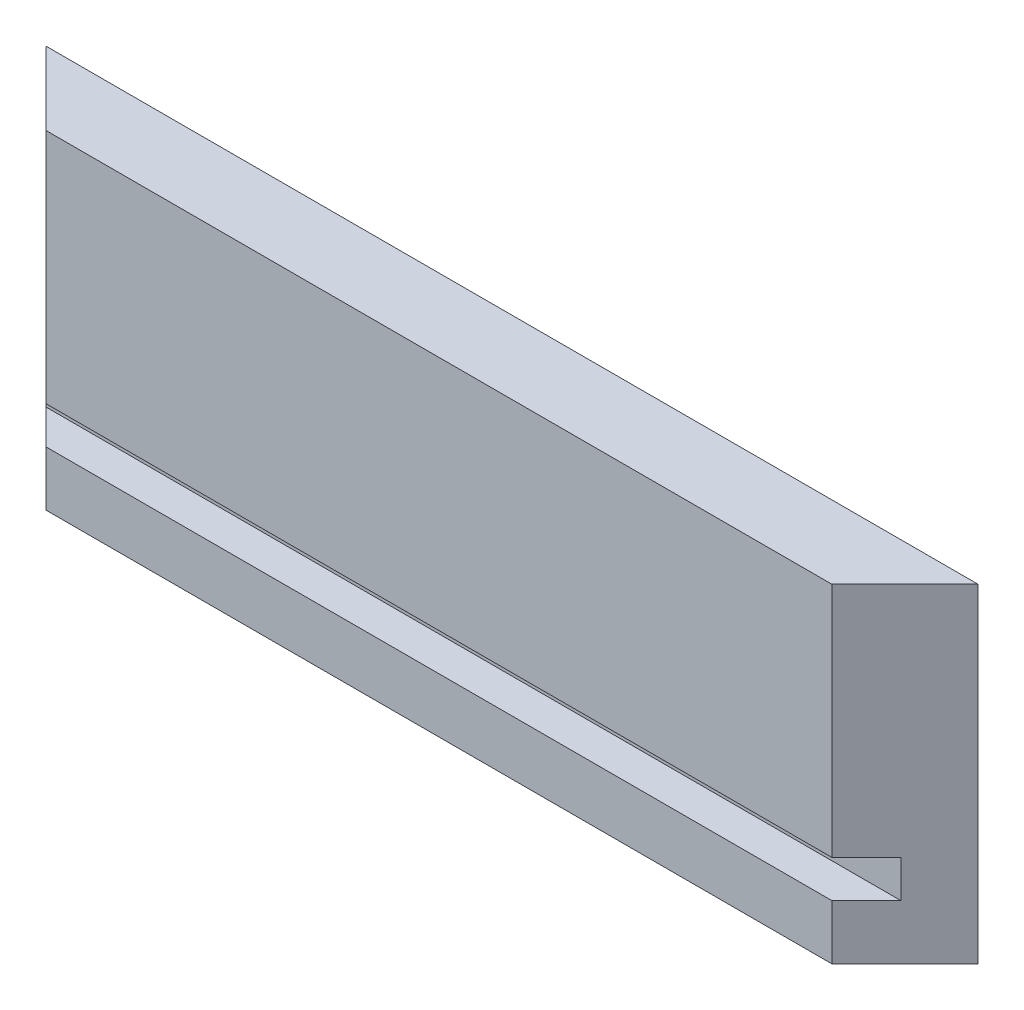
ISO-10303-21;
HEADER;
FILE_DESCRIPTION(('STEP AP214'),'2;1');
FILE_NAME('part.step','',(''),(''),'','','');
FILE_SCHEMA(('AUTOMOTIVE_DESIGN { 1 0 10303 214 1 1 1 1 }'));
ENDSEC;
DATA;
#1=APPLICATION_CONTEXT('core data for automotive mechanical design processes');
#2=APPLICATION_PROTOCOL_DEFINITION('international standard','automotive_design',2000,#1);
#3=PRODUCT_CONTEXT('',#1,'mechanical');
#4=PRODUCT('Part','Part','',(#3));
#5=PRODUCT_RELATED_PRODUCT_CATEGORY('part','',(#4));
#6=PRODUCT_DEFINITION_FORMATION('','',#4);
#7=PRODUCT_DEFINITION_CONTEXT('part definition',#1,'design');
#8=PRODUCT_DEFINITION('design','',#6,#7);
#9=PRODUCT_DEFINITION_SHAPE('','',#8);
#10=(LENGTH_UNIT() NAMED_UNIT(*) SI_UNIT(.MILLI.,.METRE.));
#11=(NAMED_UNIT(*) PLANE_ANGLE_UNIT() SI_UNIT($,.RADIAN.));
#12=(NAMED_UNIT(*) SI_UNIT($,.STERADIAN.) SOLID_ANGLE_UNIT());
#13=UNCERTAINTY_MEASURE_WITH_UNIT(LENGTH_MEASURE(1.E-05),#10,'distance_accuracy_value','');
#14=(GEOMETRIC_REPRESENTATION_CONTEXT(3) GLOBAL_UNCERTAINTY_ASSIGNED_CONTEXT((#13)) GLOBAL_UNIT_ASSIGNED_CONTEXT((#10,
#11,#12)) REPRESENTATION_CONTEXT('',''));
#15=CARTESIAN_POINT('',(0.,0.,0.));
#16=DIRECTION('',(0.,0.,1.));
#17=DIRECTION('',(1.,0.,0.));
#18=AXIS2_PLACEMENT_3D('',#15,#16,#17);
#19=CARTESIAN_POINT('',(6.34999999999999,28.575,6.35000000000001));
#20=DIRECTION('',(0.707106781186549,0.,-0.707106781186547));
#21=DIRECTION('',(-0.707106781186547,0.,-0.707106781186549));
#22=AXIS2_PLACEMENT_3D('',#19,#20,#21);
#23=PLANE('',#22);
#24=DIRECTION('',(0.707106781186547,0.,0.707106781186549));
#25=VECTOR('',#24,1.);
#26=CARTESIAN_POINT('',(6.34999999999999,4.7625,6.35));
#27=LINE('',#26,#25);
#28=CARTESIAN_POINT('',(3.35279999999999,4.7625,3.3528));
#29=VERTEX_POINT('',#28);
#30=CARTESIAN_POINT('',(6.34999999999999,4.7625,6.35));
#31=VERTEX_POINT('',#30);
#32=EDGE_CURVE('E139',#29,#31,#27,.T.);
#33=ORIENTED_EDGE('',*,*,#32,.F.);
#34=DIRECTION('',(0.,-1.,0.));
#35=VECTOR('',#34,1.);
#36=CARTESIAN_POINT('',(3.35279999999999,28.575,3.3528));
#37=LINE('',#36,#35);
#38=CARTESIAN_POINT('',(3.35280000000001,8.0137,3.35280000000001));
#39=VERTEX_POINT('',#38);
#40=EDGE_CURVE('E125',#39,#29,#37,.T.);
#41=ORIENTED_EDGE('',*,*,#40,.F.);
#42=DIRECTION('',(-0.707106781186547,0.,-0.707106781186549));
#43=VECTOR('',#42,1.);
#44=CARTESIAN_POINT('',(6.34999999999999,8.0137,6.35000000000001));
#45=LINE('',#44,#43);
#46=CARTESIAN_POINT('',(6.34999999999999,8.0137,6.35));
#47=VERTEX_POINT('',#46);
#48=EDGE_CURVE('E117',#47,#39,#45,.T.);
#49=ORIENTED_EDGE('',*,*,#48,.F.);
#50=DIRECTION('',(0.,-1.,0.));
#51=VECTOR('',#50,1.);
#52=CARTESIAN_POINT('',(6.34999999999999,28.575,6.35000000000001));
#53=LINE('',#52,#51);
#54=CARTESIAN_POINT('',(6.34999999999999,28.575,6.35000000000001));
#55=VERTEX_POINT('',#54);
#56=EDGE_CURVE('E183',#55,#47,#53,.T.);
#57=ORIENTED_EDGE('',*,*,#56,.F.);
#58=DIRECTION('',(0.707106781186546,0.,0.707106781186549));
#59=VECTOR('',#58,1.);
#60=CARTESIAN_POINT('',(6.34999999999999,28.575,6.35000000000001));
#61=LINE('',#60,#59);
#62=CARTESIAN_POINT('',(0.,28.575,0.));
#63=VERTEX_POINT('',#62);
#64=EDGE_CURVE('E149',#63,#55,#61,.T.);
#65=ORIENTED_EDGE('',*,*,#64,.F.);
#66=DIRECTION('',(0.,-1.,0.));
#67=VECTOR('',#66,1.);
#68=CARTESIAN_POINT('',(0.,28.575,0.));
#69=LINE('',#68,#67);
#70=CARTESIAN_POINT('',(0.,0.,0.));
#71=VERTEX_POINT('',#70);
#72=EDGE_CURVE('E159',#63,#71,#69,.T.);
#73=ORIENTED_EDGE('',*,*,#72,.T.);
#74=DIRECTION('',(0.707106781186546,0.,0.707106781186549));
#75=VECTOR('',#74,1.);
#76=CARTESIAN_POINT('',(6.34999999999999,0.,6.35000000000001));
#77=LINE('',#76,#75);
#78=CARTESIAN_POINT('',(6.34999999999999,0.,6.35000000000001));
#79=VERTEX_POINT('',#78);
#80=EDGE_CURVE('E145',#71,#79,#77,.T.);
#81=ORIENTED_EDGE('',*,*,#80,.T.);
#82=EDGE_CURVE('E182',#31,#79,#53,.T.);
#83=ORIENTED_EDGE('',*,*,#82,.F.);
#84=EDGE_LOOP('',(#33,#41,#49,#57,#65,#73,#81,#83));
#85=FACE_BOUND('',#84,.T.);
#86=ADVANCED_FACE('F45',(#85),#23,.F.);
#87=CARTESIAN_POINT('',(74.6506,28.575,6.35));
#88=DIRECTION('',(0.,0.,-1.));
#89=DIRECTION('',(-1.,0.,0.));
#90=AXIS2_PLACEMENT_3D('',#87,#88,#89);
#91=PLANE('',#90);
#92=DIRECTION('',(-1.,0.,0.));
#93=VECTOR('',#92,1.);
#94=CARTESIAN_POINT('',(81.0006,4.7625,6.35));
#95=LINE('',#94,#93);
#96=CARTESIAN_POINT('',(74.6506,4.7625,6.35));
#97=VERTEX_POINT('',#96);
#98=EDGE_CURVE('E126',#97,#31,#95,.T.);
#99=ORIENTED_EDGE('',*,*,#98,.T.);
#100=ORIENTED_EDGE('',*,*,#82,.T.);
#101=DIRECTION('',(1.,0.,0.));
#102=VECTOR('',#101,1.);
#103=CARTESIAN_POINT('',(74.6506,0.,6.35));
#104=LINE('',#103,#102);
#105=CARTESIAN_POINT('',(74.6506,0.,6.35));
#106=VERTEX_POINT('',#105);
#107=EDGE_CURVE('E163',#79,#106,#104,.T.);
#108=ORIENTED_EDGE('',*,*,#107,.T.);
#109=DIRECTION('',(0.,-1.,0.));
#110=VECTOR('',#109,1.);
#111=CARTESIAN_POINT('',(74.6506,28.575,6.35));
#112=LINE('',#111,#110);
#113=EDGE_CURVE('E177',#97,#106,#112,.T.);
#114=ORIENTED_EDGE('',*,*,#113,.F.);
#115=EDGE_LOOP('',(#99,#100,#108,#114));
#116=FACE_BOUND('',#115,.T.);
#117=ADVANCED_FACE('F268',(#116),#91,.F.);
#118=DIRECTION('',(-1.,0.,0.));
#119=VECTOR('',#118,1.);
#120=CARTESIAN_POINT('',(81.0006,8.0137,6.35));
#121=LINE('',#120,#119);
#122=CARTESIAN_POINT('',(74.6506,8.0137,6.35));
#123=VERTEX_POINT('',#122);
#124=EDGE_CURVE('E120',#123,#47,#121,.T.);
#125=ORIENTED_EDGE('',*,*,#124,.F.);
#126=CARTESIAN_POINT('',(74.6506,28.575,6.35));
#127=VERTEX_POINT('',#126);
#128=EDGE_CURVE('E178',#127,#123,#112,.T.);
#129=ORIENTED_EDGE('',*,*,#128,.F.);
#130=DIRECTION('',(1.,0.,0.));
#131=VECTOR('',#130,1.);
#132=CARTESIAN_POINT('',(74.6506,28.575,6.35));
#133=LINE('',#132,#131);
#134=EDGE_CURVE('E98',#55,#127,#133,.T.);
#135=ORIENTED_EDGE('',*,*,#134,.F.);
#136=ORIENTED_EDGE('',*,*,#56,.T.);
#137=EDGE_LOOP('',(#125,#129,#135,#136));
#138=FACE_BOUND('',#137,.T.);
#139=ADVANCED_FACE('F250',(#138),#91,.F.);
#140=CARTESIAN_POINT('',(81.0006,28.575,0.));
#141=DIRECTION('',(-0.707106781186549,0.,-0.707106781186546));
#142=DIRECTION('',(-0.707106781186546,0.,0.707106781186549));
#143=AXIS2_PLACEMENT_3D('',#140,#141,#142);
#144=PLANE('',#143);
#145=DIRECTION('',(0.707106781186546,0.,-0.707106781186549));
#146=VECTOR('',#145,1.);
#147=CARTESIAN_POINT('',(81.0006,4.7625,0.));
#148=LINE('',#147,#146);
#149=CARTESIAN_POINT('',(77.6478,4.7625,3.3528));
#150=VERTEX_POINT('',#149);
#151=EDGE_CURVE('E11',#97,#150,#148,.T.);
#152=ORIENTED_EDGE('',*,*,#151,.F.);
#153=ORIENTED_EDGE('',*,*,#113,.T.);
#154=DIRECTION('',(0.707106781186546,0.,-0.707106781186549));
#155=VECTOR('',#154,1.);
#156=CARTESIAN_POINT('',(81.0006,0.,0.));
#157=LINE('',#156,#155);
#158=CARTESIAN_POINT('',(81.0006,0.,0.));
#159=VERTEX_POINT('',#158);
#160=EDGE_CURVE('E167',#106,#159,#157,.T.);
#161=ORIENTED_EDGE('',*,*,#160,.T.);
#162=DIRECTION('',(0.,-1.,0.));
#163=VECTOR('',#162,1.);
#164=CARTESIAN_POINT('',(81.0006,28.575,0.));
#165=LINE('',#164,#163);
#166=CARTESIAN_POINT('',(81.0006,28.575,0.));
#167=VERTEX_POINT('',#166);
#168=EDGE_CURVE('E174',#167,#159,#165,.T.);
#169=ORIENTED_EDGE('',*,*,#168,.F.);
#170=DIRECTION('',(0.707106781186546,0.,-0.707106781186549));
#171=VECTOR('',#170,1.);
#172=CARTESIAN_POINT('',(81.0006,28.575,0.));
#173=LINE('',#172,#171);
#174=EDGE_CURVE('E154',#127,#167,#173,.T.);
#175=ORIENTED_EDGE('',*,*,#174,.F.);
#176=ORIENTED_EDGE('',*,*,#128,.T.);
#177=DIRECTION('',(-0.707106781186546,0.,0.707106781186549));
#178=VECTOR('',#177,1.);
#179=CARTESIAN_POINT('',(81.0006,8.0137,0.));
#180=LINE('',#179,#178);
#181=CARTESIAN_POINT('',(77.6478,8.0137,3.3528));
#182=VERTEX_POINT('',#181);
#183=EDGE_CURVE('E186',#182,#123,#180,.T.);
#184=ORIENTED_EDGE('',*,*,#183,.F.);
#185=DIRECTION('',(0.,1.,0.));
#186=VECTOR('',#185,1.);
#187=CARTESIAN_POINT('',(77.6478,28.575,3.3528));
#188=LINE('',#187,#186);
#189=EDGE_CURVE('E53',#150,#182,#188,.T.);
#190=ORIENTED_EDGE('',*,*,#189,.F.);
#191=EDGE_LOOP('',(#152,#153,#161,#169,#175,#176,#184,#190));
#192=FACE_BOUND('',#191,.T.);
#193=ADVANCED_FACE('F247',(#192),#144,.F.);
#194=CARTESIAN_POINT('',(0.,28.575,0.));
#195=DIRECTION('',(0.,0.,1.));
#196=DIRECTION('',(1.,0.,0.));
#197=AXIS2_PLACEMENT_3D('',#194,#195,#196);
#198=PLANE('',#197);
#199=DIRECTION('',(-1.,0.,0.));
#200=VECTOR('',#199,1.);
#201=CARTESIAN_POINT('',(0.,0.,0.));
#202=LINE('',#201,#200);
#203=EDGE_CURVE('E90',#159,#71,#202,.T.);
#204=ORIENTED_EDGE('',*,*,#203,.T.);
#205=ORIENTED_EDGE('',*,*,#72,.F.);
#206=DIRECTION('',(-1.,0.,0.));
#207=VECTOR('',#206,1.);
#208=CARTESIAN_POINT('',(0.,28.575,0.));
#209=LINE('',#208,#207);
#210=EDGE_CURVE('E69',#167,#63,#209,.T.);
#211=ORIENTED_EDGE('',*,*,#210,.F.);
#212=ORIENTED_EDGE('',*,*,#168,.T.);
#213=EDGE_LOOP('',(#204,#205,#211,#212));
#214=FACE_BOUND('',#213,.T.);
#215=ADVANCED_FACE('F256',(#214),#198,.F.);
#216=CARTESIAN_POINT('',(0.,28.575,0.));
#217=DIRECTION('',(0.,1.,0.));
#218=DIRECTION('',(0.,0.,1.));
#219=AXIS2_PLACEMENT_3D('',#216,#217,#218);
#220=PLANE('',#219);
#221=ORIENTED_EDGE('',*,*,#64,.T.);
#222=ORIENTED_EDGE('',*,*,#134,.T.);
#223=ORIENTED_EDGE('',*,*,#174,.T.);
#224=ORIENTED_EDGE('',*,*,#210,.T.);
#225=EDGE_LOOP('',(#221,#222,#223,#224));
#226=FACE_BOUND('',#225,.T.);
#227=ADVANCED_FACE('F253',(#226),#220,.T.);
#228=CARTESIAN_POINT('',(0.,0.,0.));
#229=DIRECTION('',(0.,1.,0.));
#230=DIRECTION('',(0.,0.,1.));
#231=AXIS2_PLACEMENT_3D('',#228,#229,#230);
#232=PLANE('',#231);
#233=ORIENTED_EDGE('',*,*,#80,.F.);
#234=ORIENTED_EDGE('',*,*,#203,.F.);
#235=ORIENTED_EDGE('',*,*,#160,.F.);
#236=ORIENTED_EDGE('',*,*,#107,.F.);
#237=EDGE_LOOP('',(#233,#234,#235,#236));
#238=FACE_BOUND('',#237,.T.);
#239=ADVANCED_FACE('F263',(#238),#232,.F.);
#240=CARTESIAN_POINT('',(81.0006,4.7625,6.35));
#241=DIRECTION('',(0.,1.,0.));
#242=DIRECTION('',(0.,0.,1.));
#243=AXIS2_PLACEMENT_3D('',#240,#241,#242);
#244=PLANE('',#243);
#245=ORIENTED_EDGE('',*,*,#32,.T.);
#246=ORIENTED_EDGE('',*,*,#98,.F.);
#247=ORIENTED_EDGE('',*,*,#151,.T.);
#248=DIRECTION('',(-1.,0.,0.));
#249=VECTOR('',#248,1.);
#250=CARTESIAN_POINT('',(81.0006,4.7625,3.3528));
#251=LINE('',#250,#249);
#252=EDGE_CURVE('E135',#150,#29,#251,.T.);
#253=ORIENTED_EDGE('',*,*,#252,.T.);
#254=EDGE_LOOP('',(#245,#246,#247,#253));
#255=FACE_BOUND('',#254,.T.);
#256=ADVANCED_FACE('F244',(#255),#244,.T.);
#257=CARTESIAN_POINT('',(81.0006,4.7625,3.3528));
#258=DIRECTION('',(0.,0.,1.));
#259=DIRECTION('',(1.,0.,0.));
#260=AXIS2_PLACEMENT_3D('',#257,#258,#259);
#261=PLANE('',#260);
#262=ORIENTED_EDGE('',*,*,#40,.T.);
#263=ORIENTED_EDGE('',*,*,#252,.F.);
#264=ORIENTED_EDGE('',*,*,#189,.T.);
#265=DIRECTION('',(-1.,0.,0.));
#266=VECTOR('',#265,1.);
#267=CARTESIAN_POINT('',(81.0006,8.0137,3.3528));
#268=LINE('',#267,#266);
#269=EDGE_CURVE('E60',#182,#39,#268,.T.);
#270=ORIENTED_EDGE('',*,*,#269,.T.);
#271=EDGE_LOOP('',(#262,#263,#264,#270));
#272=FACE_BOUND('',#271,.T.);
#273=ADVANCED_FACE('F129',(#272),#261,.T.);
#274=CARTESIAN_POINT('',(81.0006,8.0137,3.3528));
#275=DIRECTION('',(0.,-1.,0.));
#276=DIRECTION('',(0.,0.,-1.));
#277=AXIS2_PLACEMENT_3D('',#274,#275,#276);
#278=PLANE('',#277);
#279=ORIENTED_EDGE('',*,*,#48,.T.);
#280=ORIENTED_EDGE('',*,*,#269,.F.);
#281=ORIENTED_EDGE('',*,*,#183,.T.);
#282=ORIENTED_EDGE('',*,*,#124,.T.);
#283=EDGE_LOOP('',(#279,#280,#281,#282));
#284=FACE_BOUND('',#283,.T.);
#285=ADVANCED_FACE('F118',(#284),#278,.T.);
#286=CLOSED_SHELL('',(#86,#117,#139,#193,#215,#227,#239,#256,#273,#285));
#287=MANIFOLD_SOLID_BREP('B2',#286);
#288=ADVANCED_BREP_SHAPE_REPRESENTATION('',(#18,#287),#14);
#289=SHAPE_DEFINITION_REPRESENTATION(#9,#288);
ENDSEC;
END-ISO-10303-21;
